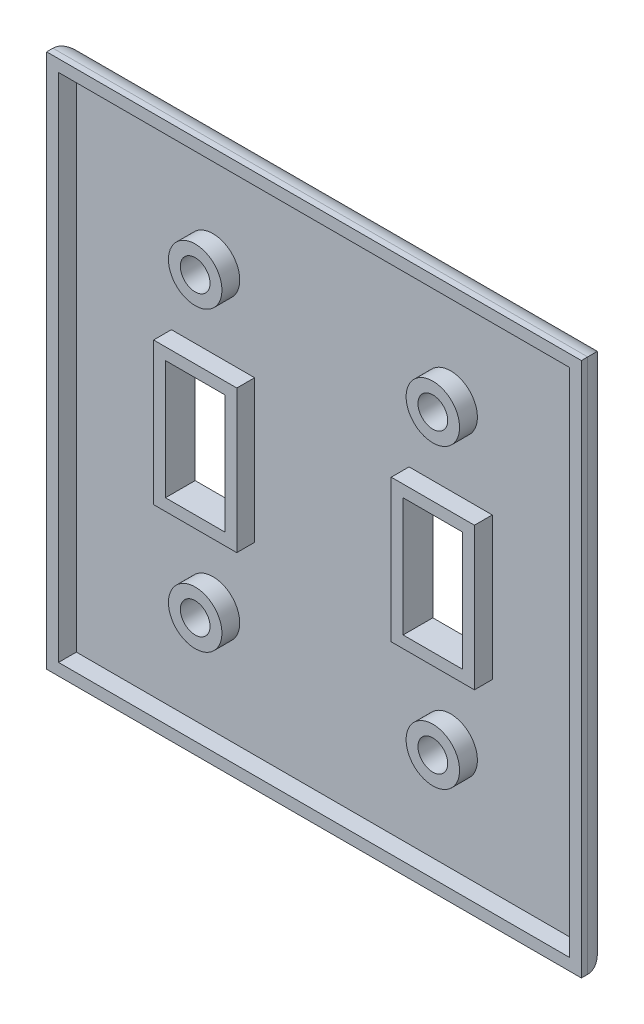
ISO-10303-21;
HEADER;
FILE_DESCRIPTION(('STEP AP214'),'2;1');
FILE_NAME('part.step','',(''),(''),'','','');
FILE_SCHEMA(('AUTOMOTIVE_DESIGN { 1 0 10303 214 1 1 1 1 }'));
ENDSEC;
DATA;
#1=APPLICATION_CONTEXT('core data for automotive mechanical design processes');
#2=APPLICATION_PROTOCOL_DEFINITION('international standard','automotive_design',2000,#1);
#3=PRODUCT_CONTEXT('',#1,'mechanical');
#4=PRODUCT('Part','Part','',(#3));
#5=PRODUCT_RELATED_PRODUCT_CATEGORY('part','',(#4));
#6=PRODUCT_DEFINITION_FORMATION('','',#4);
#7=PRODUCT_DEFINITION_CONTEXT('part definition',#1,'design');
#8=PRODUCT_DEFINITION('design','',#6,#7);
#9=PRODUCT_DEFINITION_SHAPE('','',#8);
#10=(LENGTH_UNIT() NAMED_UNIT(*) SI_UNIT(.MILLI.,.METRE.));
#11=(NAMED_UNIT(*) PLANE_ANGLE_UNIT() SI_UNIT($,.RADIAN.));
#12=(NAMED_UNIT(*) SI_UNIT($,.STERADIAN.) SOLID_ANGLE_UNIT());
#13=UNCERTAINTY_MEASURE_WITH_UNIT(LENGTH_MEASURE(1.E-05),#10,'distance_accuracy_value','');
#14=(GEOMETRIC_REPRESENTATION_CONTEXT(3) GLOBAL_UNCERTAINTY_ASSIGNED_CONTEXT((#13)) GLOBAL_UNIT_ASSIGNED_CONTEXT((#10,
#11,#12)) REPRESENTATION_CONTEXT('',''));
#15=CARTESIAN_POINT('',(0.,0.,0.));
#16=DIRECTION('',(0.,0.,1.));
#17=DIRECTION('',(1.,0.,0.));
#18=AXIS2_PLACEMENT_3D('',#15,#16,#17);
#19=CARTESIAN_POINT('',(0.,0.,6.35));
#20=DIRECTION('',(0.,0.,-1.));
#21=DIRECTION('',(-1.,0.,0.));
#22=AXIS2_PLACEMENT_3D('',#19,#20,#21);
#23=PLANE('',#22);
#24=DIRECTION('',(1.,0.,0.));
#25=VECTOR('',#24,1.);
#26=CARTESIAN_POINT('',(25.4,69.85,6.35));
#27=LINE('',#26,#25);
#28=CARTESIAN_POINT('',(25.4,69.85,6.35));
#29=VERTEX_POINT('',#28);
#30=CARTESIAN_POINT('',(38.1,69.85,6.35));
#31=VERTEX_POINT('',#30);
#32=EDGE_CURVE('E386',#29,#31,#27,.T.);
#33=ORIENTED_EDGE('',*,*,#32,.T.);
#34=DIRECTION('',(0.,-1.,0.));
#35=VECTOR('',#34,1.);
#36=CARTESIAN_POINT('',(38.1,69.85,6.35));
#37=LINE('',#36,#35);
#38=CARTESIAN_POINT('',(38.1,44.45,6.35));
#39=VERTEX_POINT('',#38);
#40=EDGE_CURVE('E401',#31,#39,#37,.T.);
#41=ORIENTED_EDGE('',*,*,#40,.T.);
#42=DIRECTION('',(1.,0.,0.));
#43=VECTOR('',#42,1.);
#44=CARTESIAN_POINT('',(25.4,44.45,6.35));
#45=LINE('',#44,#43);
#46=CARTESIAN_POINT('',(25.4,44.45,6.35));
#47=VERTEX_POINT('',#46);
#48=EDGE_CURVE('E404',#47,#39,#45,.T.);
#49=ORIENTED_EDGE('',*,*,#48,.F.);
#50=DIRECTION('',(0.,-1.,0.));
#51=VECTOR('',#50,1.);
#52=CARTESIAN_POINT('',(25.4,69.85,6.35));
#53=LINE('',#52,#51);
#54=EDGE_CURVE('E390',#29,#47,#53,.T.);
#55=ORIENTED_EDGE('',*,*,#54,.F.);
#56=EDGE_LOOP('',(#33,#41,#49,#55));
#57=FACE_BOUND('',#56,.T.);
#58=DIRECTION('',(1.,0.,0.));
#59=VECTOR('',#58,1.);
#60=CARTESIAN_POINT('',(25.4,72.39,6.35));
#61=LINE('',#60,#59);
#62=CARTESIAN_POINT('',(22.86,72.39,6.35));
#63=VERTEX_POINT('',#62);
#64=CARTESIAN_POINT('',(40.64,72.39,6.35));
#65=VERTEX_POINT('',#64);
#66=EDGE_CURVE('E303',#63,#65,#61,.T.);
#67=ORIENTED_EDGE('',*,*,#66,.F.);
#68=DIRECTION('',(0.,-1.,0.));
#69=VECTOR('',#68,1.);
#70=CARTESIAN_POINT('',(22.86,69.85,6.35));
#71=LINE('',#70,#69);
#72=CARTESIAN_POINT('',(22.86,41.91,6.35));
#73=VERTEX_POINT('',#72);
#74=EDGE_CURVE('E265',#63,#73,#71,.T.);
#75=ORIENTED_EDGE('',*,*,#74,.T.);
#76=DIRECTION('',(1.,0.,0.));
#77=VECTOR('',#76,1.);
#78=CARTESIAN_POINT('',(25.4,41.91,6.35));
#79=LINE('',#78,#77);
#80=CARTESIAN_POINT('',(40.64,41.91,6.35));
#81=VERTEX_POINT('',#80);
#82=EDGE_CURVE('E329',#73,#81,#79,.T.);
#83=ORIENTED_EDGE('',*,*,#82,.T.);
#84=DIRECTION('',(0.,-1.,0.));
#85=VECTOR('',#84,1.);
#86=CARTESIAN_POINT('',(40.64,69.85,6.35));
#87=LINE('',#86,#85);
#88=EDGE_CURVE('E326',#65,#81,#87,.T.);
#89=ORIENTED_EDGE('',*,*,#88,.F.);
#90=EDGE_LOOP('',(#67,#75,#83,#89));
#91=FACE_BOUND('',#90,.T.);
#92=ADVANCED_FACE('F49',(#57,#91),#23,.F.);
#93=CARTESIAN_POINT('',(82.55,25.4,6.35));
#94=DIRECTION('',(0.,0.,-1.));
#95=DIRECTION('',(-1.,0.,0.));
#96=AXIS2_PLACEMENT_3D('',#93,#94,#95);
#97=CIRCLE('',#96,5.715);
#98=CARTESIAN_POINT('',(76.835,25.4,6.35));
#99=VERTEX_POINT('',#98);
#100=EDGE_CURVE('E346',#99,#99,#97,.F.);
#101=ORIENTED_EDGE('',*,*,#100,.T.);
#102=EDGE_LOOP('',(#101));
#103=FACE_BOUND('',#102,.T.);
#104=CARTESIAN_POINT('',(82.55,25.4,6.35));
#105=DIRECTION('',(0.,0.,1.));
#106=DIRECTION('',(1.,0.,0.));
#107=AXIS2_PLACEMENT_3D('',#104,#105,#106);
#108=CIRCLE('',#107,3.175);
#109=CARTESIAN_POINT('',(85.725,25.4,6.35));
#110=VERTEX_POINT('',#109);
#111=EDGE_CURVE('E284',#110,#110,#108,.T.);
#112=ORIENTED_EDGE('',*,*,#111,.F.);
#113=EDGE_LOOP('',(#112));
#114=FACE_BOUND('',#113,.T.);
#115=ADVANCED_FACE('F518',(#103,#114),#23,.F.);
#116=CARTESIAN_POINT('',(31.75,25.4,6.35));
#117=DIRECTION('',(0.,0.,-1.));
#118=DIRECTION('',(-1.,0.,0.));
#119=AXIS2_PLACEMENT_3D('',#116,#117,#118);
#120=CIRCLE('',#119,5.715);
#121=CARTESIAN_POINT('',(26.035,25.4,6.35));
#122=VERTEX_POINT('',#121);
#123=EDGE_CURVE('E294',#122,#122,#120,.F.);
#124=ORIENTED_EDGE('',*,*,#123,.T.);
#125=EDGE_LOOP('',(#124));
#126=FACE_BOUND('',#125,.T.);
#127=CARTESIAN_POINT('',(31.75,25.4,6.35));
#128=DIRECTION('',(0.,0.,1.));
#129=DIRECTION('',(1.,0.,0.));
#130=AXIS2_PLACEMENT_3D('',#127,#128,#129);
#131=CIRCLE('',#130,3.175);
#132=CARTESIAN_POINT('',(34.925,25.4,6.35));
#133=VERTEX_POINT('',#132);
#134=EDGE_CURVE('E418',#133,#133,#131,.T.);
#135=ORIENTED_EDGE('',*,*,#134,.F.);
#136=EDGE_LOOP('',(#135));
#137=FACE_BOUND('',#136,.T.);
#138=ADVANCED_FACE('F526',(#126,#137),#23,.F.);
#139=CARTESIAN_POINT('',(82.55,88.9,6.35));
#140=DIRECTION('',(0.,0.,-1.));
#141=DIRECTION('',(-1.,0.,0.));
#142=AXIS2_PLACEMENT_3D('',#139,#140,#141);
#143=CIRCLE('',#142,5.715);
#144=CARTESIAN_POINT('',(76.835,88.9,6.35));
#145=VERTEX_POINT('',#144);
#146=EDGE_CURVE('E318',#145,#145,#143,.F.);
#147=ORIENTED_EDGE('',*,*,#146,.T.);
#148=EDGE_LOOP('',(#147));
#149=FACE_BOUND('',#148,.T.);
#150=CARTESIAN_POINT('',(82.55,88.9,6.35));
#151=DIRECTION('',(0.,0.,1.));
#152=DIRECTION('',(1.,0.,0.));
#153=AXIS2_PLACEMENT_3D('',#150,#151,#152);
#154=CIRCLE('',#153,3.175);
#155=CARTESIAN_POINT('',(85.725,88.9,6.35));
#156=VERTEX_POINT('',#155);
#157=EDGE_CURVE('E422',#156,#156,#154,.T.);
#158=ORIENTED_EDGE('',*,*,#157,.F.);
#159=EDGE_LOOP('',(#158));
#160=FACE_BOUND('',#159,.T.);
#161=ADVANCED_FACE('F681',(#149,#160),#23,.F.);
#162=DIRECTION('',(0.,-1.,0.));
#163=VECTOR('',#162,1.);
#164=CARTESIAN_POINT('',(0.,0.,6.35));
#165=LINE('',#164,#163);
#166=CARTESIAN_POINT('',(0.,114.3,6.35));
#167=VERTEX_POINT('',#166);
#168=CARTESIAN_POINT('',(0.,0.,6.35));
#169=VERTEX_POINT('',#168);
#170=EDGE_CURVE('E434',#167,#169,#165,.T.);
#171=ORIENTED_EDGE('',*,*,#170,.T.);
#172=DIRECTION('',(1.,0.,0.));
#173=VECTOR('',#172,1.);
#174=CARTESIAN_POINT('',(0.,0.,6.35));
#175=LINE('',#174,#173);
#176=CARTESIAN_POINT('',(114.3,0.,6.35));
#177=VERTEX_POINT('',#176);
#178=EDGE_CURVE('E439',#169,#177,#175,.T.);
#179=ORIENTED_EDGE('',*,*,#178,.T.);
#180=DIRECTION('',(0.,1.,0.));
#181=VECTOR('',#180,1.);
#182=CARTESIAN_POINT('',(114.3,0.,6.35));
#183=LINE('',#182,#181);
#184=CARTESIAN_POINT('',(114.3,114.3,6.35));
#185=VERTEX_POINT('',#184);
#186=EDGE_CURVE('E441',#177,#185,#183,.T.);
#187=ORIENTED_EDGE('',*,*,#186,.T.);
#188=DIRECTION('',(-1.,0.,0.));
#189=VECTOR('',#188,1.);
#190=CARTESIAN_POINT('',(0.,114.3,6.35));
#191=LINE('',#190,#189);
#192=EDGE_CURVE('E443',#185,#167,#191,.T.);
#193=ORIENTED_EDGE('',*,*,#192,.T.);
#194=EDGE_LOOP('',(#171,#179,#187,#193));
#195=FACE_BOUND('',#194,.T.);
#196=DIRECTION('',(0.,-1.,0.));
#197=VECTOR('',#196,1.);
#198=CARTESIAN_POINT('',(2.54,0.,6.35));
#199=LINE('',#198,#197);
#200=CARTESIAN_POINT('',(2.54,111.76,6.35));
#201=VERTEX_POINT('',#200);
#202=CARTESIAN_POINT('',(2.54,2.54,6.35));
#203=VERTEX_POINT('',#202);
#204=EDGE_CURVE('E235',#201,#203,#199,.T.);
#205=ORIENTED_EDGE('',*,*,#204,.F.);
#206=DIRECTION('',(-1.,0.,0.));
#207=VECTOR('',#206,1.);
#208=CARTESIAN_POINT('',(0.,111.76,6.35));
#209=LINE('',#208,#207);
#210=CARTESIAN_POINT('',(111.76,111.76,6.35));
#211=VERTEX_POINT('',#210);
#212=EDGE_CURVE('E241',#211,#201,#209,.T.);
#213=ORIENTED_EDGE('',*,*,#212,.F.);
#214=DIRECTION('',(0.,1.,0.));
#215=VECTOR('',#214,1.);
#216=CARTESIAN_POINT('',(111.76,0.,6.35));
#217=LINE('',#216,#215);
#218=CARTESIAN_POINT('',(111.76,2.54,6.35));
#219=VERTEX_POINT('',#218);
#220=EDGE_CURVE('E311',#219,#211,#217,.T.);
#221=ORIENTED_EDGE('',*,*,#220,.F.);
#222=DIRECTION('',(1.,0.,0.));
#223=VECTOR('',#222,1.);
#224=CARTESIAN_POINT('',(0.,2.54,6.35));
#225=LINE('',#224,#223);
#226=EDGE_CURVE('E309',#203,#219,#225,.T.);
#227=ORIENTED_EDGE('',*,*,#226,.F.);
#228=EDGE_LOOP('',(#205,#213,#221,#227));
#229=FACE_BOUND('',#228,.T.);
#230=ADVANCED_FACE('F502',(#195,#229),#23,.F.);
#231=DIRECTION('',(1.,0.,0.));
#232=VECTOR('',#231,1.);
#233=CARTESIAN_POINT('',(76.1999999999999,69.85,6.35));
#234=LINE('',#233,#232);
#235=CARTESIAN_POINT('',(76.1999999999999,69.85,6.35));
#236=VERTEX_POINT('',#235);
#237=CARTESIAN_POINT('',(88.9,69.85,6.35));
#238=VERTEX_POINT('',#237);
#239=EDGE_CURVE('E352',#236,#238,#234,.T.);
#240=ORIENTED_EDGE('',*,*,#239,.T.);
#241=DIRECTION('',(0.,-1.,0.));
#242=VECTOR('',#241,1.);
#243=CARTESIAN_POINT('',(88.9,69.85,6.35));
#244=LINE('',#243,#242);
#245=CARTESIAN_POINT('',(88.9,44.45,6.35));
#246=VERTEX_POINT('',#245);
#247=EDGE_CURVE('E369',#238,#246,#244,.T.);
#248=ORIENTED_EDGE('',*,*,#247,.T.);
#249=DIRECTION('',(1.,0.,0.));
#250=VECTOR('',#249,1.);
#251=CARTESIAN_POINT('',(76.2,44.45,6.35));
#252=LINE('',#251,#250);
#253=CARTESIAN_POINT('',(76.2,44.45,6.35));
#254=VERTEX_POINT('',#253);
#255=EDGE_CURVE('E372',#254,#246,#252,.T.);
#256=ORIENTED_EDGE('',*,*,#255,.F.);
#257=DIRECTION('',(0.,-1.,0.));
#258=VECTOR('',#257,1.);
#259=CARTESIAN_POINT('',(76.1999999999999,69.85,6.35));
#260=LINE('',#259,#258);
#261=EDGE_CURVE('E358',#236,#254,#260,.T.);
#262=ORIENTED_EDGE('',*,*,#261,.F.);
#263=EDGE_LOOP('',(#240,#248,#256,#262));
#264=FACE_BOUND('',#263,.T.);
#265=DIRECTION('',(1.,0.,0.));
#266=VECTOR('',#265,1.);
#267=CARTESIAN_POINT('',(76.1999999999999,72.39,6.35));
#268=LINE('',#267,#266);
#269=CARTESIAN_POINT('',(73.66,72.39,6.35));
#270=VERTEX_POINT('',#269);
#271=CARTESIAN_POINT('',(91.44,72.39,6.35));
#272=VERTEX_POINT('',#271);
#273=EDGE_CURVE('E334',#270,#272,#268,.T.);
#274=ORIENTED_EDGE('',*,*,#273,.F.);
#275=DIRECTION('',(0.,-1.,0.));
#276=VECTOR('',#275,1.);
#277=CARTESIAN_POINT('',(73.66,69.85,6.35));
#278=LINE('',#277,#276);
#279=CARTESIAN_POINT('',(73.66,41.91,6.35));
#280=VERTEX_POINT('',#279);
#281=EDGE_CURVE('E277',#270,#280,#278,.T.);
#282=ORIENTED_EDGE('',*,*,#281,.T.);
#283=DIRECTION('',(1.,0.,0.));
#284=VECTOR('',#283,1.);
#285=CARTESIAN_POINT('',(76.2,41.91,6.35));
#286=LINE('',#285,#284);
#287=CARTESIAN_POINT('',(91.44,41.91,6.35));
#288=VERTEX_POINT('',#287);
#289=EDGE_CURVE('E341',#280,#288,#286,.T.);
#290=ORIENTED_EDGE('',*,*,#289,.T.);
#291=DIRECTION('',(0.,-1.,0.));
#292=VECTOR('',#291,1.);
#293=CARTESIAN_POINT('',(91.44,69.85,6.35));
#294=LINE('',#293,#292);
#295=EDGE_CURVE('E337',#272,#288,#294,.T.);
#296=ORIENTED_EDGE('',*,*,#295,.F.);
#297=EDGE_LOOP('',(#274,#282,#290,#296));
#298=FACE_BOUND('',#297,.T.);
#299=ADVANCED_FACE('F532',(#264,#298),#23,.F.);
#300=CARTESIAN_POINT('',(31.75,88.9,6.35));
#301=DIRECTION('',(0.,0.,-1.));
#302=DIRECTION('',(-1.,0.,0.));
#303=AXIS2_PLACEMENT_3D('',#300,#301,#302);
#304=CIRCLE('',#303,5.715);
#305=CARTESIAN_POINT('',(26.035,88.9,6.35));
#306=VERTEX_POINT('',#305);
#307=EDGE_CURVE('E255',#306,#306,#304,.F.);
#308=ORIENTED_EDGE('',*,*,#307,.T.);
#309=EDGE_LOOP('',(#308));
#310=FACE_BOUND('',#309,.T.);
#311=CARTESIAN_POINT('',(31.75,88.9,6.35));
#312=DIRECTION('',(0.,0.,1.));
#313=DIRECTION('',(1.,0.,0.));
#314=AXIS2_PLACEMENT_3D('',#311,#312,#313);
#315=CIRCLE('',#314,3.175);
#316=CARTESIAN_POINT('',(34.925,88.9,6.35));
#317=VERTEX_POINT('',#316);
#318=EDGE_CURVE('E428',#317,#317,#315,.T.);
#319=ORIENTED_EDGE('',*,*,#318,.F.);
#320=EDGE_LOOP('',(#319));
#321=FACE_BOUND('',#320,.T.);
#322=ADVANCED_FACE('F521',(#310,#321),#23,.F.);
#323=CARTESIAN_POINT('',(0.,0.,0.));
#324=DIRECTION('',(0.,0.,-1.));
#325=DIRECTION('',(-1.,0.,0.));
#326=AXIS2_PLACEMENT_3D('',#323,#324,#325);
#327=PLANE('',#326);
#328=DIRECTION('',(1.,0.,0.));
#329=VECTOR('',#328,1.);
#330=CARTESIAN_POINT('',(0.,5.,0.));
#331=LINE('',#330,#329);
#332=CARTESIAN_POINT('',(109.3,5.,0.));
#333=VERTEX_POINT('',#332);
#334=CARTESIAN_POINT('',(5.,5.,0.));
#335=VERTEX_POINT('',#334);
#336=EDGE_CURVE('E461',#333,#335,#331,.F.);
#337=ORIENTED_EDGE('',*,*,#336,.T.);
#338=DIRECTION('',(0.,-1.,0.));
#339=VECTOR('',#338,1.);
#340=CARTESIAN_POINT('',(5.,114.3,0.));
#341=LINE('',#340,#339);
#342=CARTESIAN_POINT('',(5.,109.3,0.));
#343=VERTEX_POINT('',#342);
#344=EDGE_CURVE('E463',#335,#343,#341,.F.);
#345=ORIENTED_EDGE('',*,*,#344,.T.);
#346=DIRECTION('',(-1.,0.,0.));
#347=VECTOR('',#346,1.);
#348=CARTESIAN_POINT('',(114.3,109.3,0.));
#349=LINE('',#348,#347);
#350=CARTESIAN_POINT('',(109.3,109.3,0.));
#351=VERTEX_POINT('',#350);
#352=EDGE_CURVE('E457',#343,#351,#349,.F.);
#353=ORIENTED_EDGE('',*,*,#352,.T.);
#354=DIRECTION('',(0.,1.,0.));
#355=VECTOR('',#354,1.);
#356=CARTESIAN_POINT('',(109.3,0.,0.));
#357=LINE('',#356,#355);
#358=EDGE_CURVE('E459',#351,#333,#357,.F.);
#359=ORIENTED_EDGE('',*,*,#358,.T.);
#360=EDGE_LOOP('',(#337,#345,#353,#359));
#361=FACE_BOUND('',#360,.T.);
#362=CARTESIAN_POINT('',(82.55,25.4,0.));
#363=DIRECTION('',(0.,0.,1.));
#364=DIRECTION('',(1.,0.,0.));
#365=AXIS2_PLACEMENT_3D('',#362,#363,#364);
#366=CIRCLE('',#365,3.175);
#367=CARTESIAN_POINT('',(85.725,25.4,0.));
#368=VERTEX_POINT('',#367);
#369=EDGE_CURVE('E349',#368,#368,#366,.T.);
#370=ORIENTED_EDGE('',*,*,#369,.T.);
#371=EDGE_LOOP('',(#370));
#372=FACE_BOUND('',#371,.T.);
#373=CARTESIAN_POINT('',(31.75,25.4,0.));
#374=DIRECTION('',(0.,0.,1.));
#375=DIRECTION('',(1.,0.,0.));
#376=AXIS2_PLACEMENT_3D('',#373,#374,#375);
#377=CIRCLE('',#376,3.175);
#378=CARTESIAN_POINT('',(34.925,25.4,0.));
#379=VERTEX_POINT('',#378);
#380=EDGE_CURVE('E419',#379,#379,#377,.T.);
#381=ORIENTED_EDGE('',*,*,#380,.T.);
#382=EDGE_LOOP('',(#381));
#383=FACE_BOUND('',#382,.T.);
#384=CARTESIAN_POINT('',(82.55,88.9,0.));
#385=DIRECTION('',(0.,0.,1.));
#386=DIRECTION('',(1.,0.,0.));
#387=AXIS2_PLACEMENT_3D('',#384,#385,#386);
#388=CIRCLE('',#387,3.175);
#389=CARTESIAN_POINT('',(85.725,88.9,0.));
#390=VERTEX_POINT('',#389);
#391=EDGE_CURVE('E425',#390,#390,#388,.T.);
#392=ORIENTED_EDGE('',*,*,#391,.T.);
#393=EDGE_LOOP('',(#392));
#394=FACE_BOUND('',#393,.T.);
#395=CARTESIAN_POINT('',(31.75,88.9,0.));
#396=DIRECTION('',(0.,0.,1.));
#397=DIRECTION('',(1.,0.,0.));
#398=AXIS2_PLACEMENT_3D('',#395,#396,#397);
#399=CIRCLE('',#398,3.175);
#400=CARTESIAN_POINT('',(34.925,88.9,0.));
#401=VERTEX_POINT('',#400);
#402=EDGE_CURVE('E431',#401,#401,#399,.T.);
#403=ORIENTED_EDGE('',*,*,#402,.T.);
#404=EDGE_LOOP('',(#403));
#405=FACE_BOUND('',#404,.T.);
#406=DIRECTION('',(0.,-1.,0.));
#407=VECTOR('',#406,1.);
#408=CARTESIAN_POINT('',(38.1,69.85,0.));
#409=LINE('',#408,#407);
#410=CARTESIAN_POINT('',(38.1,69.85,0.));
#411=VERTEX_POINT('',#410);
#412=CARTESIAN_POINT('',(38.1,44.45,0.));
#413=VERTEX_POINT('',#412);
#414=EDGE_CURVE('E389',#411,#413,#409,.T.);
#415=ORIENTED_EDGE('',*,*,#414,.F.);
#416=DIRECTION('',(1.,0.,0.));
#417=VECTOR('',#416,1.);
#418=CARTESIAN_POINT('',(25.4,69.85,0.));
#419=LINE('',#418,#417);
#420=CARTESIAN_POINT('',(25.4,69.85,0.));
#421=VERTEX_POINT('',#420);
#422=EDGE_CURVE('E387',#421,#411,#419,.T.);
#423=ORIENTED_EDGE('',*,*,#422,.F.);
#424=DIRECTION('',(0.,-1.,0.));
#425=VECTOR('',#424,1.);
#426=CARTESIAN_POINT('',(25.4,69.85,0.));
#427=LINE('',#426,#425);
#428=CARTESIAN_POINT('',(25.4,44.45,0.));
#429=VERTEX_POINT('',#428);
#430=EDGE_CURVE('E395',#421,#429,#427,.T.);
#431=ORIENTED_EDGE('',*,*,#430,.T.);
#432=DIRECTION('',(1.,0.,0.));
#433=VECTOR('',#432,1.);
#434=CARTESIAN_POINT('',(25.4,44.45,0.));
#435=LINE('',#434,#433);
#436=EDGE_CURVE('E392',#429,#413,#435,.T.);
#437=ORIENTED_EDGE('',*,*,#436,.T.);
#438=EDGE_LOOP('',(#415,#423,#431,#437));
#439=FACE_BOUND('',#438,.T.);
#440=DIRECTION('',(0.,-1.,0.));
#441=VECTOR('',#440,1.);
#442=CARTESIAN_POINT('',(88.9,69.85,0.));
#443=LINE('',#442,#441);
#444=CARTESIAN_POINT('',(88.9,69.85,0.));
#445=VERTEX_POINT('',#444);
#446=CARTESIAN_POINT('',(88.9,44.45,0.));
#447=VERTEX_POINT('',#446);
#448=EDGE_CURVE('E357',#445,#447,#443,.T.);
#449=ORIENTED_EDGE('',*,*,#448,.F.);
#450=DIRECTION('',(1.,0.,0.));
#451=VECTOR('',#450,1.);
#452=CARTESIAN_POINT('',(76.1999999999999,69.85,0.));
#453=LINE('',#452,#451);
#454=CARTESIAN_POINT('',(76.1999999999999,69.85,0.));
#455=VERTEX_POINT('',#454);
#456=EDGE_CURVE('E355',#455,#445,#453,.T.);
#457=ORIENTED_EDGE('',*,*,#456,.F.);
#458=DIRECTION('',(0.,-1.,0.));
#459=VECTOR('',#458,1.);
#460=CARTESIAN_POINT('',(76.1999999999999,69.85,0.));
#461=LINE('',#460,#459);
#462=CARTESIAN_POINT('',(76.2,44.45,0.));
#463=VERTEX_POINT('',#462);
#464=EDGE_CURVE('E363',#455,#463,#461,.T.);
#465=ORIENTED_EDGE('',*,*,#464,.T.);
#466=DIRECTION('',(1.,0.,0.));
#467=VECTOR('',#466,1.);
#468=CARTESIAN_POINT('',(76.2,44.45,0.));
#469=LINE('',#468,#467);
#470=EDGE_CURVE('E360',#463,#447,#469,.T.);
#471=ORIENTED_EDGE('',*,*,#470,.T.);
#472=EDGE_LOOP('',(#449,#457,#465,#471));
#473=FACE_BOUND('',#472,.T.);
#474=ADVANCED_FACE('F486',(#361,#372,#383,#394,#405,#439,#473),#327,.T.);
#475=CARTESIAN_POINT('',(0.,0.,6.35));
#476=DIRECTION('',(1.,0.,0.));
#477=DIRECTION('',(0.,0.,-1.));
#478=AXIS2_PLACEMENT_3D('',#475,#476,#477);
#479=PLANE('',#478);
#480=DIRECTION('',(0.,0.,-1.));
#481=VECTOR('',#480,1.);
#482=CARTESIAN_POINT('',(0.,114.3,6.35));
#483=LINE('',#482,#481);
#484=CARTESIAN_POINT('',(0.,114.3,5.));
#485=VERTEX_POINT('',#484);
#486=EDGE_CURVE('E445',#167,#485,#483,.T.);
#487=ORIENTED_EDGE('',*,*,#486,.T.);
#488=DIRECTION('',(0.,-1.,0.));
#489=VECTOR('',#488,1.);
#490=CARTESIAN_POINT('',(0.,0.,5.));
#491=LINE('',#490,#489);
#492=CARTESIAN_POINT('',(0.,0.,5.));
#493=VERTEX_POINT('',#492);
#494=EDGE_CURVE('E454',#485,#493,#491,.T.);
#495=ORIENTED_EDGE('',*,*,#494,.T.);
#496=DIRECTION('',(0.,0.,-1.));
#497=VECTOR('',#496,1.);
#498=CARTESIAN_POINT('',(0.,0.,6.35));
#499=LINE('',#498,#497);
#500=EDGE_CURVE('E452',#169,#493,#499,.T.);
#501=ORIENTED_EDGE('',*,*,#500,.F.);
#502=ORIENTED_EDGE('',*,*,#170,.F.);
#503=EDGE_LOOP('',(#487,#495,#501,#502));
#504=FACE_BOUND('',#503,.T.);
#505=ADVANCED_FACE('F496',(#504),#479,.F.);
#506=CARTESIAN_POINT('',(0.,0.,6.35));
#507=DIRECTION('',(0.,1.,0.));
#508=DIRECTION('',(0.,0.,1.));
#509=AXIS2_PLACEMENT_3D('',#506,#507,#508);
#510=PLANE('',#509);
#511=ORIENTED_EDGE('',*,*,#500,.T.);
#512=DIRECTION('',(1.,0.,0.));
#513=VECTOR('',#512,1.);
#514=CARTESIAN_POINT('',(114.3,0.,5.));
#515=LINE('',#514,#513);
#516=CARTESIAN_POINT('',(114.3,0.,5.));
#517=VERTEX_POINT('',#516);
#518=EDGE_CURVE('E73',#493,#517,#515,.T.);
#519=ORIENTED_EDGE('',*,*,#518,.T.);
#520=DIRECTION('',(0.,0.,-1.));
#521=VECTOR('',#520,1.);
#522=CARTESIAN_POINT('',(114.3,0.,6.35));
#523=LINE('',#522,#521);
#524=EDGE_CURVE('E450',#177,#517,#523,.T.);
#525=ORIENTED_EDGE('',*,*,#524,.F.);
#526=ORIENTED_EDGE('',*,*,#178,.F.);
#527=EDGE_LOOP('',(#511,#519,#525,#526));
#528=FACE_BOUND('',#527,.T.);
#529=ADVANCED_FACE('F499',(#528),#510,.F.);
#530=CARTESIAN_POINT('',(114.3,0.,6.35));
#531=DIRECTION('',(-1.,0.,0.));
#532=DIRECTION('',(0.,0.,1.));
#533=AXIS2_PLACEMENT_3D('',#530,#531,#532);
#534=PLANE('',#533);
#535=ORIENTED_EDGE('',*,*,#524,.T.);
#536=DIRECTION('',(0.,1.,0.));
#537=VECTOR('',#536,1.);
#538=CARTESIAN_POINT('',(114.3,114.3,5.));
#539=LINE('',#538,#537);
#540=CARTESIAN_POINT('',(114.3,114.3,5.));
#541=VERTEX_POINT('',#540);
#542=EDGE_CURVE('E58',#517,#541,#539,.T.);
#543=ORIENTED_EDGE('',*,*,#542,.T.);
#544=DIRECTION('',(0.,0.,-1.));
#545=VECTOR('',#544,1.);
#546=CARTESIAN_POINT('',(114.3,114.3,6.35));
#547=LINE('',#546,#545);
#548=EDGE_CURVE('E448',#185,#541,#547,.T.);
#549=ORIENTED_EDGE('',*,*,#548,.F.);
#550=ORIENTED_EDGE('',*,*,#186,.F.);
#551=EDGE_LOOP('',(#535,#543,#549,#550));
#552=FACE_BOUND('',#551,.T.);
#553=ADVANCED_FACE('F507',(#552),#534,.F.);
#554=CARTESIAN_POINT('',(0.,114.3,6.35));
#555=DIRECTION('',(0.,-1.,0.));
#556=DIRECTION('',(0.,0.,-1.));
#557=AXIS2_PLACEMENT_3D('',#554,#555,#556);
#558=PLANE('',#557);
#559=ORIENTED_EDGE('',*,*,#548,.T.);
#560=DIRECTION('',(-1.,0.,0.));
#561=VECTOR('',#560,1.);
#562=CARTESIAN_POINT('',(0.,114.3,5.));
#563=LINE('',#562,#561);
#564=EDGE_CURVE('E13',#541,#485,#563,.T.);
#565=ORIENTED_EDGE('',*,*,#564,.T.);
#566=ORIENTED_EDGE('',*,*,#486,.F.);
#567=ORIENTED_EDGE('',*,*,#192,.F.);
#568=EDGE_LOOP('',(#559,#565,#566,#567));
#569=FACE_BOUND('',#568,.T.);
#570=ADVANCED_FACE('F506',(#569),#558,.F.);
#571=CARTESIAN_POINT('',(31.75,88.9,0.));
#572=DIRECTION('',(0.,0.,1.));
#573=DIRECTION('',(1.,0.,0.));
#574=AXIS2_PLACEMENT_3D('',#571,#572,#573);
#575=CYLINDRICAL_SURFACE('',#574,3.175);
#576=ORIENTED_EDGE('',*,*,#402,.F.);
#577=EDGE_LOOP('',(#576));
#578=FACE_BOUND('',#577,.T.);
#579=ORIENTED_EDGE('',*,*,#318,.T.);
#580=EDGE_LOOP('',(#579));
#581=FACE_BOUND('',#580,.T.);
#582=ADVANCED_FACE('F514',(#578,#581),#575,.F.);
#583=CARTESIAN_POINT('',(82.55,88.9,0.));
#584=DIRECTION('',(0.,0.,1.));
#585=DIRECTION('',(1.,0.,0.));
#586=AXIS2_PLACEMENT_3D('',#583,#584,#585);
#587=CYLINDRICAL_SURFACE('',#586,3.175);
#588=ORIENTED_EDGE('',*,*,#391,.F.);
#589=EDGE_LOOP('',(#588));
#590=FACE_BOUND('',#589,.T.);
#591=ORIENTED_EDGE('',*,*,#157,.T.);
#592=EDGE_LOOP('',(#591));
#593=FACE_BOUND('',#592,.T.);
#594=ADVANCED_FACE('F545',(#590,#593),#587,.F.);
#595=CARTESIAN_POINT('',(31.75,25.4,0.));
#596=DIRECTION('',(0.,0.,1.));
#597=DIRECTION('',(1.,0.,0.));
#598=AXIS2_PLACEMENT_3D('',#595,#596,#597);
#599=CYLINDRICAL_SURFACE('',#598,3.175);
#600=ORIENTED_EDGE('',*,*,#380,.F.);
#601=EDGE_LOOP('',(#600));
#602=FACE_BOUND('',#601,.T.);
#603=ORIENTED_EDGE('',*,*,#134,.T.);
#604=EDGE_LOOP('',(#603));
#605=FACE_BOUND('',#604,.T.);
#606=ADVANCED_FACE('F551',(#602,#605),#599,.F.);
#607=CARTESIAN_POINT('',(25.4,69.85,0.));
#608=DIRECTION('',(0.,-1.,0.));
#609=DIRECTION('',(0.,0.,-1.));
#610=AXIS2_PLACEMENT_3D('',#607,#608,#609);
#611=PLANE('',#610);
#612=ORIENTED_EDGE('',*,*,#32,.F.);
#613=DIRECTION('',(0.,0.,1.));
#614=VECTOR('',#613,1.);
#615=CARTESIAN_POINT('',(25.4,69.85,0.));
#616=LINE('',#615,#614);
#617=EDGE_CURVE('E398',#421,#29,#616,.T.);
#618=ORIENTED_EDGE('',*,*,#617,.F.);
#619=ORIENTED_EDGE('',*,*,#422,.T.);
#620=DIRECTION('',(0.,0.,1.));
#621=VECTOR('',#620,1.);
#622=CARTESIAN_POINT('',(38.1,69.85,0.));
#623=LINE('',#622,#621);
#624=EDGE_CURVE('E415',#411,#31,#623,.T.);
#625=ORIENTED_EDGE('',*,*,#624,.T.);
#626=EDGE_LOOP('',(#612,#618,#619,#625));
#627=FACE_BOUND('',#626,.T.);
#628=ADVANCED_FACE('F558',(#627),#611,.T.);
#629=CARTESIAN_POINT('',(38.1,69.85,0.));
#630=DIRECTION('',(-1.,0.,0.));
#631=DIRECTION('',(0.,0.,1.));
#632=AXIS2_PLACEMENT_3D('',#629,#630,#631);
#633=PLANE('',#632);
#634=ORIENTED_EDGE('',*,*,#40,.F.);
#635=ORIENTED_EDGE('',*,*,#624,.F.);
#636=ORIENTED_EDGE('',*,*,#414,.T.);
#637=DIRECTION('',(0.,0.,1.));
#638=VECTOR('',#637,1.);
#639=CARTESIAN_POINT('',(38.1,44.45,0.));
#640=LINE('',#639,#638);
#641=EDGE_CURVE('E413',#413,#39,#640,.T.);
#642=ORIENTED_EDGE('',*,*,#641,.T.);
#643=EDGE_LOOP('',(#634,#635,#636,#642));
#644=FACE_BOUND('',#643,.T.);
#645=ADVANCED_FACE('F562',(#644),#633,.T.);
#646=CARTESIAN_POINT('',(25.4,44.45,0.));
#647=DIRECTION('',(0.,-1.,0.));
#648=DIRECTION('',(0.,0.,-1.));
#649=AXIS2_PLACEMENT_3D('',#646,#647,#648);
#650=PLANE('',#649);
#651=ORIENTED_EDGE('',*,*,#48,.T.);
#652=ORIENTED_EDGE('',*,*,#641,.F.);
#653=ORIENTED_EDGE('',*,*,#436,.F.);
#654=DIRECTION('',(0.,0.,1.));
#655=VECTOR('',#654,1.);
#656=CARTESIAN_POINT('',(25.4,44.45,0.));
#657=LINE('',#656,#655);
#658=EDGE_CURVE('E411',#429,#47,#657,.T.);
#659=ORIENTED_EDGE('',*,*,#658,.T.);
#660=EDGE_LOOP('',(#651,#652,#653,#659));
#661=FACE_BOUND('',#660,.T.);
#662=ADVANCED_FACE('F566',(#661),#650,.F.);
#663=CARTESIAN_POINT('',(25.4,69.85,0.));
#664=DIRECTION('',(-1.,0.,0.));
#665=DIRECTION('',(0.,-1.,0.));
#666=AXIS2_PLACEMENT_3D('',#663,#664,#665);
#667=PLANE('',#666);
#668=ORIENTED_EDGE('',*,*,#54,.T.);
#669=ORIENTED_EDGE('',*,*,#658,.F.);
#670=ORIENTED_EDGE('',*,*,#430,.F.);
#671=ORIENTED_EDGE('',*,*,#617,.T.);
#672=EDGE_LOOP('',(#668,#669,#670,#671));
#673=FACE_BOUND('',#672,.T.);
#674=ADVANCED_FACE('F570',(#673),#667,.F.);
#675=CARTESIAN_POINT('',(76.1999999999999,69.85,0.));
#676=DIRECTION('',(0.,-1.,0.));
#677=DIRECTION('',(0.,0.,-1.));
#678=AXIS2_PLACEMENT_3D('',#675,#676,#677);
#679=PLANE('',#678);
#680=ORIENTED_EDGE('',*,*,#239,.F.);
#681=DIRECTION('',(0.,0.,1.));
#682=VECTOR('',#681,1.);
#683=CARTESIAN_POINT('',(76.1999999999999,69.85,0.));
#684=LINE('',#683,#682);
#685=EDGE_CURVE('E366',#455,#236,#684,.T.);
#686=ORIENTED_EDGE('',*,*,#685,.F.);
#687=ORIENTED_EDGE('',*,*,#456,.T.);
#688=DIRECTION('',(0.,0.,1.));
#689=VECTOR('',#688,1.);
#690=CARTESIAN_POINT('',(88.9,69.85,0.));
#691=LINE('',#690,#689);
#692=EDGE_CURVE('E383',#445,#238,#691,.T.);
#693=ORIENTED_EDGE('',*,*,#692,.T.);
#694=EDGE_LOOP('',(#680,#686,#687,#693));
#695=FACE_BOUND('',#694,.T.);
#696=ADVANCED_FACE('F574',(#695),#679,.T.);
#697=CARTESIAN_POINT('',(88.9,69.85,0.));
#698=DIRECTION('',(-1.,0.,0.));
#699=DIRECTION('',(0.,0.,1.));
#700=AXIS2_PLACEMENT_3D('',#697,#698,#699);
#701=PLANE('',#700);
#702=ORIENTED_EDGE('',*,*,#247,.F.);
#703=ORIENTED_EDGE('',*,*,#692,.F.);
#704=ORIENTED_EDGE('',*,*,#448,.T.);
#705=DIRECTION('',(0.,0.,1.));
#706=VECTOR('',#705,1.);
#707=CARTESIAN_POINT('',(88.9,44.45,0.));
#708=LINE('',#707,#706);
#709=EDGE_CURVE('E381',#447,#246,#708,.T.);
#710=ORIENTED_EDGE('',*,*,#709,.T.);
#711=EDGE_LOOP('',(#702,#703,#704,#710));
#712=FACE_BOUND('',#711,.T.);
#713=ADVANCED_FACE('F578',(#712),#701,.T.);
#714=CARTESIAN_POINT('',(76.2,44.45,0.));
#715=DIRECTION('',(0.,-1.,0.));
#716=DIRECTION('',(1.,0.,0.));
#717=AXIS2_PLACEMENT_3D('',#714,#715,#716);
#718=PLANE('',#717);
#719=ORIENTED_EDGE('',*,*,#255,.T.);
#720=ORIENTED_EDGE('',*,*,#709,.F.);
#721=ORIENTED_EDGE('',*,*,#470,.F.);
#722=DIRECTION('',(0.,0.,1.));
#723=VECTOR('',#722,1.);
#724=CARTESIAN_POINT('',(76.2,44.45,0.));
#725=LINE('',#724,#723);
#726=EDGE_CURVE('E379',#463,#254,#725,.T.);
#727=ORIENTED_EDGE('',*,*,#726,.T.);
#728=EDGE_LOOP('',(#719,#720,#721,#727));
#729=FACE_BOUND('',#728,.T.);
#730=ADVANCED_FACE('F582',(#729),#718,.F.);
#731=CARTESIAN_POINT('',(76.1999999999999,69.85,0.));
#732=DIRECTION('',(-1.,0.,0.));
#733=DIRECTION('',(0.,-1.,0.));
#734=AXIS2_PLACEMENT_3D('',#731,#732,#733);
#735=PLANE('',#734);
#736=ORIENTED_EDGE('',*,*,#261,.T.);
#737=ORIENTED_EDGE('',*,*,#726,.F.);
#738=ORIENTED_EDGE('',*,*,#464,.F.);
#739=ORIENTED_EDGE('',*,*,#685,.T.);
#740=EDGE_LOOP('',(#736,#737,#738,#739));
#741=FACE_BOUND('',#740,.T.);
#742=ADVANCED_FACE('F586',(#741),#735,.F.);
#743=CARTESIAN_POINT('',(82.55,25.4,0.));
#744=DIRECTION('',(0.,0.,1.));
#745=DIRECTION('',(1.,0.,0.));
#746=AXIS2_PLACEMENT_3D('',#743,#744,#745);
#747=CYLINDRICAL_SURFACE('',#746,3.175);
#748=ORIENTED_EDGE('',*,*,#369,.F.);
#749=EDGE_LOOP('',(#748));
#750=FACE_BOUND('',#749,.T.);
#751=ORIENTED_EDGE('',*,*,#111,.T.);
#752=EDGE_LOOP('',(#751));
#753=FACE_BOUND('',#752,.T.);
#754=ADVANCED_FACE('F590',(#750,#753),#747,.F.);
#755=CARTESIAN_POINT('',(0.,0.,2.54));
#756=DIRECTION('',(0.,0.,-1.));
#757=DIRECTION('',(-1.,0.,0.));
#758=AXIS2_PLACEMENT_3D('',#755,#756,#757);
#759=PLANE('',#758);
#760=CARTESIAN_POINT('',(82.55,25.4,2.54));
#761=DIRECTION('',(0.,0.,-1.));
#762=DIRECTION('',(-1.,0.,0.));
#763=AXIS2_PLACEMENT_3D('',#760,#761,#762);
#764=CIRCLE('',#763,5.715);
#765=CARTESIAN_POINT('',(76.835,25.4,2.54));
#766=VERTEX_POINT('',#765);
#767=EDGE_CURVE('E338',#766,#766,#764,.F.);
#768=ORIENTED_EDGE('',*,*,#767,.F.);
#769=EDGE_LOOP('',(#768));
#770=FACE_BOUND('',#769,.T.);
#771=CARTESIAN_POINT('',(31.75,25.4,2.54));
#772=DIRECTION('',(0.,0.,-1.));
#773=DIRECTION('',(-1.,0.,0.));
#774=AXIS2_PLACEMENT_3D('',#771,#772,#773);
#775=CIRCLE('',#774,5.715);
#776=CARTESIAN_POINT('',(26.035,25.4,2.54));
#777=VERTEX_POINT('',#776);
#778=EDGE_CURVE('E321',#777,#777,#775,.F.);
#779=ORIENTED_EDGE('',*,*,#778,.F.);
#780=EDGE_LOOP('',(#779));
#781=FACE_BOUND('',#780,.T.);
#782=CARTESIAN_POINT('',(82.55,88.9,2.54));
#783=DIRECTION('',(0.,0.,-1.));
#784=DIRECTION('',(-1.,0.,0.));
#785=AXIS2_PLACEMENT_3D('',#782,#783,#784);
#786=CIRCLE('',#785,5.715);
#787=CARTESIAN_POINT('',(76.835,88.9,2.54));
#788=VERTEX_POINT('',#787);
#789=EDGE_CURVE('E317',#788,#788,#786,.F.);
#790=ORIENTED_EDGE('',*,*,#789,.F.);
#791=EDGE_LOOP('',(#790));
#792=FACE_BOUND('',#791,.T.);
#793=CARTESIAN_POINT('',(31.75,88.9,2.54));
#794=DIRECTION('',(0.,0.,-1.));
#795=DIRECTION('',(-1.,0.,0.));
#796=AXIS2_PLACEMENT_3D('',#793,#794,#795);
#797=CIRCLE('',#796,5.715);
#798=CARTESIAN_POINT('',(26.035,88.9,2.54));
#799=VERTEX_POINT('',#798);
#800=EDGE_CURVE('E251',#799,#799,#797,.F.);
#801=ORIENTED_EDGE('',*,*,#800,.F.);
#802=EDGE_LOOP('',(#801));
#803=FACE_BOUND('',#802,.T.);
#804=DIRECTION('',(0.,-1.,0.));
#805=VECTOR('',#804,1.);
#806=CARTESIAN_POINT('',(2.54,0.,2.54));
#807=LINE('',#806,#805);
#808=CARTESIAN_POINT('',(2.54,111.76,2.54));
#809=VERTEX_POINT('',#808);
#810=CARTESIAN_POINT('',(2.54,2.54,2.54));
#811=VERTEX_POINT('',#810);
#812=EDGE_CURVE('E230',#809,#811,#807,.T.);
#813=ORIENTED_EDGE('',*,*,#812,.T.);
#814=DIRECTION('',(1.,0.,0.));
#815=VECTOR('',#814,1.);
#816=CARTESIAN_POINT('',(0.,2.54,2.54));
#817=LINE('',#816,#815);
#818=CARTESIAN_POINT('',(111.76,2.54,2.54));
#819=VERTEX_POINT('',#818);
#820=EDGE_CURVE('E250',#811,#819,#817,.T.);
#821=ORIENTED_EDGE('',*,*,#820,.T.);
#822=DIRECTION('',(0.,1.,0.));
#823=VECTOR('',#822,1.);
#824=CARTESIAN_POINT('',(111.76,0.,2.54));
#825=LINE('',#824,#823);
#826=CARTESIAN_POINT('',(111.76,111.76,2.54));
#827=VERTEX_POINT('',#826);
#828=EDGE_CURVE('E232',#819,#827,#825,.T.);
#829=ORIENTED_EDGE('',*,*,#828,.T.);
#830=DIRECTION('',(-1.,0.,0.));
#831=VECTOR('',#830,1.);
#832=CARTESIAN_POINT('',(0.,111.76,2.54));
#833=LINE('',#832,#831);
#834=EDGE_CURVE('E225',#827,#809,#833,.T.);
#835=ORIENTED_EDGE('',*,*,#834,.T.);
#836=EDGE_LOOP('',(#813,#821,#829,#835));
#837=FACE_BOUND('',#836,.T.);
#838=DIRECTION('',(0.,-1.,0.));
#839=VECTOR('',#838,1.);
#840=CARTESIAN_POINT('',(40.64,69.85,2.54));
#841=LINE('',#840,#839);
#842=CARTESIAN_POINT('',(40.64,72.39,2.54));
#843=VERTEX_POINT('',#842);
#844=CARTESIAN_POINT('',(40.64,41.91,2.54));
#845=VERTEX_POINT('',#844);
#846=EDGE_CURVE('E260',#843,#845,#841,.T.);
#847=ORIENTED_EDGE('',*,*,#846,.T.);
#848=DIRECTION('',(1.,0.,0.));
#849=VECTOR('',#848,1.);
#850=CARTESIAN_POINT('',(25.4,41.91,2.54));
#851=LINE('',#850,#849);
#852=CARTESIAN_POINT('',(22.86,41.91,2.54));
#853=VERTEX_POINT('',#852);
#854=EDGE_CURVE('E262',#853,#845,#851,.T.);
#855=ORIENTED_EDGE('',*,*,#854,.F.);
#856=DIRECTION('',(0.,-1.,0.));
#857=VECTOR('',#856,1.);
#858=CARTESIAN_POINT('',(22.86,69.85,2.54));
#859=LINE('',#858,#857);
#860=CARTESIAN_POINT('',(22.86,72.39,2.54));
#861=VERTEX_POINT('',#860);
#862=EDGE_CURVE('E266',#861,#853,#859,.T.);
#863=ORIENTED_EDGE('',*,*,#862,.F.);
#864=DIRECTION('',(1.,0.,0.));
#865=VECTOR('',#864,1.);
#866=CARTESIAN_POINT('',(25.4,72.39,2.54));
#867=LINE('',#866,#865);
#868=EDGE_CURVE('E263',#861,#843,#867,.T.);
#869=ORIENTED_EDGE('',*,*,#868,.T.);
#870=EDGE_LOOP('',(#847,#855,#863,#869));
#871=FACE_BOUND('',#870,.T.);
#872=DIRECTION('',(0.,-1.,0.));
#873=VECTOR('',#872,1.);
#874=CARTESIAN_POINT('',(91.44,69.85,2.54));
#875=LINE('',#874,#873);
#876=CARTESIAN_POINT('',(91.44,72.39,2.54));
#877=VERTEX_POINT('',#876);
#878=CARTESIAN_POINT('',(91.44,41.91,2.54));
#879=VERTEX_POINT('',#878);
#880=EDGE_CURVE('E272',#877,#879,#875,.T.);
#881=ORIENTED_EDGE('',*,*,#880,.T.);
#882=DIRECTION('',(1.,0.,0.));
#883=VECTOR('',#882,1.);
#884=CARTESIAN_POINT('',(76.2,41.91,2.54));
#885=LINE('',#884,#883);
#886=CARTESIAN_POINT('',(73.66,41.91,2.54));
#887=VERTEX_POINT('',#886);
#888=EDGE_CURVE('E274',#887,#879,#885,.T.);
#889=ORIENTED_EDGE('',*,*,#888,.F.);
#890=DIRECTION('',(0.,-1.,0.));
#891=VECTOR('',#890,1.);
#892=CARTESIAN_POINT('',(73.66,69.85,2.54));
#893=LINE('',#892,#891);
#894=CARTESIAN_POINT('',(73.66,72.39,2.54));
#895=VERTEX_POINT('',#894);
#896=EDGE_CURVE('E278',#895,#887,#893,.T.);
#897=ORIENTED_EDGE('',*,*,#896,.F.);
#898=DIRECTION('',(1.,0.,0.));
#899=VECTOR('',#898,1.);
#900=CARTESIAN_POINT('',(76.1999999999999,72.39,2.54));
#901=LINE('',#900,#899);
#902=EDGE_CURVE('E275',#895,#877,#901,.T.);
#903=ORIENTED_EDGE('',*,*,#902,.T.);
#904=EDGE_LOOP('',(#881,#889,#897,#903));
#905=FACE_BOUND('',#904,.T.);
#906=ADVANCED_FACE('F227',(#770,#781,#792,#803,#837,#871,#905),#759,.F.);
#907=CARTESIAN_POINT('',(2.54,0.,6.35));
#908=DIRECTION('',(1.,0.,0.));
#909=DIRECTION('',(0.,0.,-1.));
#910=AXIS2_PLACEMENT_3D('',#907,#908,#909);
#911=PLANE('',#910);
#912=ORIENTED_EDGE('',*,*,#812,.F.);
#913=DIRECTION('',(0.,0.,-1.));
#914=VECTOR('',#913,1.);
#915=CARTESIAN_POINT('',(2.54,111.76,6.35));
#916=LINE('',#915,#914);
#917=EDGE_CURVE('E238',#201,#809,#916,.T.);
#918=ORIENTED_EDGE('',*,*,#917,.F.);
#919=ORIENTED_EDGE('',*,*,#204,.T.);
#920=DIRECTION('',(0.,0.,-1.));
#921=VECTOR('',#920,1.);
#922=CARTESIAN_POINT('',(2.54,2.54,6.35));
#923=LINE('',#922,#921);
#924=EDGE_CURVE('E249',#203,#811,#923,.T.);
#925=ORIENTED_EDGE('',*,*,#924,.T.);
#926=EDGE_LOOP('',(#912,#918,#919,#925));
#927=FACE_BOUND('',#926,.T.);
#928=ADVANCED_FACE('F247',(#927),#911,.T.);
#929=CARTESIAN_POINT('',(0.,2.54,6.35));
#930=DIRECTION('',(0.,1.,0.));
#931=DIRECTION('',(0.,0.,1.));
#932=AXIS2_PLACEMENT_3D('',#929,#930,#931);
#933=PLANE('',#932);
#934=ORIENTED_EDGE('',*,*,#820,.F.);
#935=ORIENTED_EDGE('',*,*,#924,.F.);
#936=ORIENTED_EDGE('',*,*,#226,.T.);
#937=DIRECTION('',(0.,0.,-1.));
#938=VECTOR('',#937,1.);
#939=CARTESIAN_POINT('',(111.76,2.54,6.35));
#940=LINE('',#939,#938);
#941=EDGE_CURVE('E285',#219,#819,#940,.T.);
#942=ORIENTED_EDGE('',*,*,#941,.T.);
#943=EDGE_LOOP('',(#934,#935,#936,#942));
#944=FACE_BOUND('',#943,.T.);
#945=ADVANCED_FACE('F648',(#944),#933,.T.);
#946=CARTESIAN_POINT('',(111.76,0.,6.35));
#947=DIRECTION('',(-1.,0.,0.));
#948=DIRECTION('',(0.,0.,1.));
#949=AXIS2_PLACEMENT_3D('',#946,#947,#948);
#950=PLANE('',#949);
#951=ORIENTED_EDGE('',*,*,#828,.F.);
#952=ORIENTED_EDGE('',*,*,#941,.F.);
#953=ORIENTED_EDGE('',*,*,#220,.T.);
#954=DIRECTION('',(0.,0.,-1.));
#955=VECTOR('',#954,1.);
#956=CARTESIAN_POINT('',(111.76,111.76,6.35));
#957=LINE('',#956,#955);
#958=EDGE_CURVE('E244',#211,#827,#957,.T.);
#959=ORIENTED_EDGE('',*,*,#958,.T.);
#960=EDGE_LOOP('',(#951,#952,#953,#959));
#961=FACE_BOUND('',#960,.T.);
#962=ADVANCED_FACE('F645',(#961),#950,.T.);
#963=CARTESIAN_POINT('',(0.,111.76,6.35));
#964=DIRECTION('',(0.,-1.,0.));
#965=DIRECTION('',(0.,0.,-1.));
#966=AXIS2_PLACEMENT_3D('',#963,#964,#965);
#967=PLANE('',#966);
#968=ORIENTED_EDGE('',*,*,#834,.F.);
#969=ORIENTED_EDGE('',*,*,#958,.F.);
#970=ORIENTED_EDGE('',*,*,#212,.T.);
#971=ORIENTED_EDGE('',*,*,#917,.T.);
#972=EDGE_LOOP('',(#968,#969,#970,#971));
#973=FACE_BOUND('',#972,.T.);
#974=ADVANCED_FACE('F239',(#973),#967,.T.);
#975=CARTESIAN_POINT('',(31.75,88.9,0.));
#976=DIRECTION('',(0.,0.,1.));
#977=DIRECTION('',(1.,0.,0.));
#978=AXIS2_PLACEMENT_3D('',#975,#976,#977);
#979=CYLINDRICAL_SURFACE('',#978,5.715);
#980=ORIENTED_EDGE('',*,*,#800,.T.);
#981=EDGE_LOOP('',(#980));
#982=FACE_BOUND('',#981,.T.);
#983=ORIENTED_EDGE('',*,*,#307,.F.);
#984=EDGE_LOOP('',(#983));
#985=FACE_BOUND('',#984,.T.);
#986=ADVANCED_FACE('F638',(#982,#985),#979,.T.);
#987=CARTESIAN_POINT('',(82.55,88.9,0.));
#988=DIRECTION('',(0.,0.,1.));
#989=DIRECTION('',(1.,0.,0.));
#990=AXIS2_PLACEMENT_3D('',#987,#988,#989);
#991=CYLINDRICAL_SURFACE('',#990,5.715);
#992=ORIENTED_EDGE('',*,*,#789,.T.);
#993=EDGE_LOOP('',(#992));
#994=FACE_BOUND('',#993,.T.);
#995=ORIENTED_EDGE('',*,*,#146,.F.);
#996=EDGE_LOOP('',(#995));
#997=FACE_BOUND('',#996,.T.);
#998=ADVANCED_FACE('F634',(#994,#997),#991,.T.);
#999=CARTESIAN_POINT('',(31.75,25.4,0.));
#1000=DIRECTION('',(0.,0.,1.));
#1001=DIRECTION('',(1.,0.,0.));
#1002=AXIS2_PLACEMENT_3D('',#999,#1000,#1001);
#1003=CYLINDRICAL_SURFACE('',#1002,5.715);
#1004=ORIENTED_EDGE('',*,*,#778,.T.);
#1005=EDGE_LOOP('',(#1004));
#1006=FACE_BOUND('',#1005,.T.);
#1007=ORIENTED_EDGE('',*,*,#123,.F.);
#1008=EDGE_LOOP('',(#1007));
#1009=FACE_BOUND('',#1008,.T.);
#1010=ADVANCED_FACE('F630',(#1006,#1009),#1003,.T.);
#1011=CARTESIAN_POINT('',(25.4,72.39,0.));
#1012=DIRECTION('',(0.,-1.,0.));
#1013=DIRECTION('',(0.,0.,-1.));
#1014=AXIS2_PLACEMENT_3D('',#1011,#1012,#1013);
#1015=PLANE('',#1014);
#1016=ORIENTED_EDGE('',*,*,#66,.T.);
#1017=DIRECTION('',(0.,0.,1.));
#1018=VECTOR('',#1017,1.);
#1019=CARTESIAN_POINT('',(40.64,72.39,0.));
#1020=LINE('',#1019,#1018);
#1021=EDGE_CURVE('E292',#843,#65,#1020,.T.);
#1022=ORIENTED_EDGE('',*,*,#1021,.F.);
#1023=ORIENTED_EDGE('',*,*,#868,.F.);
#1024=DIRECTION('',(0.,0.,1.));
#1025=VECTOR('',#1024,1.);
#1026=CARTESIAN_POINT('',(22.86,72.39,0.));
#1027=LINE('',#1026,#1025);
#1028=EDGE_CURVE('E269',#861,#63,#1027,.T.);
#1029=ORIENTED_EDGE('',*,*,#1028,.T.);
#1030=EDGE_LOOP('',(#1016,#1022,#1023,#1029));
#1031=FACE_BOUND('',#1030,.T.);
#1032=ADVANCED_FACE('F626',(#1031),#1015,.F.);
#1033=CARTESIAN_POINT('',(40.64,69.85,0.));
#1034=DIRECTION('',(-1.,0.,0.));
#1035=DIRECTION('',(0.,0.,1.));
#1036=AXIS2_PLACEMENT_3D('',#1033,#1034,#1035);
#1037=PLANE('',#1036);
#1038=ORIENTED_EDGE('',*,*,#88,.T.);
#1039=DIRECTION('',(0.,0.,1.));
#1040=VECTOR('',#1039,1.);
#1041=CARTESIAN_POINT('',(40.64,41.91,0.));
#1042=LINE('',#1041,#1040);
#1043=EDGE_CURVE('E295',#845,#81,#1042,.T.);
#1044=ORIENTED_EDGE('',*,*,#1043,.F.);
#1045=ORIENTED_EDGE('',*,*,#846,.F.);
#1046=ORIENTED_EDGE('',*,*,#1021,.T.);
#1047=EDGE_LOOP('',(#1038,#1044,#1045,#1046));
#1048=FACE_BOUND('',#1047,.T.);
#1049=ADVANCED_FACE('F622',(#1048),#1037,.F.);
#1050=CARTESIAN_POINT('',(25.4,41.91,0.));
#1051=DIRECTION('',(0.,-1.,0.));
#1052=DIRECTION('',(0.,0.,-1.));
#1053=AXIS2_PLACEMENT_3D('',#1050,#1051,#1052);
#1054=PLANE('',#1053);
#1055=ORIENTED_EDGE('',*,*,#82,.F.);
#1056=DIRECTION('',(0.,0.,1.));
#1057=VECTOR('',#1056,1.);
#1058=CARTESIAN_POINT('',(22.86,41.91,0.));
#1059=LINE('',#1058,#1057);
#1060=EDGE_CURVE('E291',#853,#73,#1059,.T.);
#1061=ORIENTED_EDGE('',*,*,#1060,.F.);
#1062=ORIENTED_EDGE('',*,*,#854,.T.);
#1063=ORIENTED_EDGE('',*,*,#1043,.T.);
#1064=EDGE_LOOP('',(#1055,#1061,#1062,#1063));
#1065=FACE_BOUND('',#1064,.T.);
#1066=ADVANCED_FACE('F618',(#1065),#1054,.T.);
#1067=CARTESIAN_POINT('',(22.86,69.85,0.));
#1068=DIRECTION('',(-1.,0.,0.));
#1069=DIRECTION('',(0.,-1.,0.));
#1070=AXIS2_PLACEMENT_3D('',#1067,#1068,#1069);
#1071=PLANE('',#1070);
#1072=ORIENTED_EDGE('',*,*,#74,.F.);
#1073=ORIENTED_EDGE('',*,*,#1028,.F.);
#1074=ORIENTED_EDGE('',*,*,#862,.T.);
#1075=ORIENTED_EDGE('',*,*,#1060,.T.);
#1076=EDGE_LOOP('',(#1072,#1073,#1074,#1075));
#1077=FACE_BOUND('',#1076,.T.);
#1078=ADVANCED_FACE('F614',(#1077),#1071,.T.);
#1079=CARTESIAN_POINT('',(76.1999999999999,72.39,0.));
#1080=DIRECTION('',(0.,-1.,0.));
#1081=DIRECTION('',(0.,0.,-1.));
#1082=AXIS2_PLACEMENT_3D('',#1079,#1080,#1081);
#1083=PLANE('',#1082);
#1084=ORIENTED_EDGE('',*,*,#273,.T.);
#1085=DIRECTION('',(0.,0.,1.));
#1086=VECTOR('',#1085,1.);
#1087=CARTESIAN_POINT('',(91.44,72.39,0.));
#1088=LINE('',#1087,#1086);
#1089=EDGE_CURVE('E301',#877,#272,#1088,.T.);
#1090=ORIENTED_EDGE('',*,*,#1089,.F.);
#1091=ORIENTED_EDGE('',*,*,#902,.F.);
#1092=DIRECTION('',(0.,0.,1.));
#1093=VECTOR('',#1092,1.);
#1094=CARTESIAN_POINT('',(73.66,72.39,0.));
#1095=LINE('',#1094,#1093);
#1096=EDGE_CURVE('E281',#895,#270,#1095,.T.);
#1097=ORIENTED_EDGE('',*,*,#1096,.T.);
#1098=EDGE_LOOP('',(#1084,#1090,#1091,#1097));
#1099=FACE_BOUND('',#1098,.T.);
#1100=ADVANCED_FACE('F610',(#1099),#1083,.F.);
#1101=CARTESIAN_POINT('',(91.44,69.85,0.));
#1102=DIRECTION('',(-1.,0.,0.));
#1103=DIRECTION('',(0.,0.,1.));
#1104=AXIS2_PLACEMENT_3D('',#1101,#1102,#1103);
#1105=PLANE('',#1104);
#1106=ORIENTED_EDGE('',*,*,#295,.T.);
#1107=DIRECTION('',(0.,0.,1.));
#1108=VECTOR('',#1107,1.);
#1109=CARTESIAN_POINT('',(91.44,41.91,0.));
#1110=LINE('',#1109,#1108);
#1111=EDGE_CURVE('E304',#879,#288,#1110,.T.);
#1112=ORIENTED_EDGE('',*,*,#1111,.F.);
#1113=ORIENTED_EDGE('',*,*,#880,.F.);
#1114=ORIENTED_EDGE('',*,*,#1089,.T.);
#1115=EDGE_LOOP('',(#1106,#1112,#1113,#1114));
#1116=FACE_BOUND('',#1115,.T.);
#1117=ADVANCED_FACE('F606',(#1116),#1105,.F.);
#1118=CARTESIAN_POINT('',(76.2,41.91,0.));
#1119=DIRECTION('',(0.,-1.,0.));
#1120=DIRECTION('',(1.,0.,0.));
#1121=AXIS2_PLACEMENT_3D('',#1118,#1119,#1120);
#1122=PLANE('',#1121);
#1123=ORIENTED_EDGE('',*,*,#289,.F.);
#1124=DIRECTION('',(0.,0.,1.));
#1125=VECTOR('',#1124,1.);
#1126=CARTESIAN_POINT('',(73.66,41.91,0.));
#1127=LINE('',#1126,#1125);
#1128=EDGE_CURVE('E300',#887,#280,#1127,.T.);
#1129=ORIENTED_EDGE('',*,*,#1128,.F.);
#1130=ORIENTED_EDGE('',*,*,#888,.T.);
#1131=ORIENTED_EDGE('',*,*,#1111,.T.);
#1132=EDGE_LOOP('',(#1123,#1129,#1130,#1131));
#1133=FACE_BOUND('',#1132,.T.);
#1134=ADVANCED_FACE('F602',(#1133),#1122,.T.);
#1135=CARTESIAN_POINT('',(73.66,69.85,0.));
#1136=DIRECTION('',(-1.,0.,0.));
#1137=DIRECTION('',(0.,-1.,0.));
#1138=AXIS2_PLACEMENT_3D('',#1135,#1136,#1137);
#1139=PLANE('',#1138);
#1140=ORIENTED_EDGE('',*,*,#281,.F.);
#1141=ORIENTED_EDGE('',*,*,#1096,.F.);
#1142=ORIENTED_EDGE('',*,*,#896,.T.);
#1143=ORIENTED_EDGE('',*,*,#1128,.T.);
#1144=EDGE_LOOP('',(#1140,#1141,#1142,#1143));
#1145=FACE_BOUND('',#1144,.T.);
#1146=ADVANCED_FACE('F598',(#1145),#1139,.T.);
#1147=CARTESIAN_POINT('',(82.55,25.4,0.));
#1148=DIRECTION('',(0.,0.,1.));
#1149=DIRECTION('',(1.,0.,0.));
#1150=AXIS2_PLACEMENT_3D('',#1147,#1148,#1149);
#1151=CYLINDRICAL_SURFACE('',#1150,5.715);
#1152=ORIENTED_EDGE('',*,*,#767,.T.);
#1153=EDGE_LOOP('',(#1152));
#1154=FACE_BOUND('',#1153,.T.);
#1155=ORIENTED_EDGE('',*,*,#100,.F.);
#1156=EDGE_LOOP('',(#1155));
#1157=FACE_BOUND('',#1156,.T.);
#1158=ADVANCED_FACE('F595',(#1154,#1157),#1151,.T.);
#1159=CARTESIAN_POINT('',(109.3,0.,5.));
#1160=DIRECTION('',(0.,-1.,0.));
#1161=DIRECTION('',(0.,0.,-1.));
#1162=AXIS2_PLACEMENT_3D('',#1159,#1160,#1161);
#1163=CYLINDRICAL_SURFACE('',#1162,5.);
#1164=CARTESIAN_POINT('',(109.3,5.,5.));
#1165=DIRECTION('',(-0.707106781186547,-0.707106781186547,0.));
#1166=DIRECTION('',(0.707106781186547,-0.707106781186547,0.));
#1167=AXIS2_PLACEMENT_3D('',#1164,#1165,#1166);
#1168=ELLIPSE('',#1167,7.07106781186547,5.);
#1169=EDGE_CURVE('E471',#333,#517,#1168,.T.);
#1170=ORIENTED_EDGE('',*,*,#1169,.F.);
#1171=ORIENTED_EDGE('',*,*,#358,.F.);
#1172=CARTESIAN_POINT('',(109.3,109.3,5.));
#1173=DIRECTION('',(0.707106781186547,-0.707106781186547,0.));
#1174=DIRECTION('',(0.707106781186547,0.707106781186547,0.));
#1175=AXIS2_PLACEMENT_3D('',#1172,#1173,#1174);
#1176=ELLIPSE('',#1175,7.07106781186547,5.);
#1177=EDGE_CURVE('E53',#541,#351,#1176,.F.);
#1178=ORIENTED_EDGE('',*,*,#1177,.F.);
#1179=ORIENTED_EDGE('',*,*,#542,.F.);
#1180=EDGE_LOOP('',(#1170,#1171,#1178,#1179));
#1181=FACE_BOUND('',#1180,.T.);
#1182=ADVANCED_FACE('F51',(#1181),#1163,.T.);
#1183=CARTESIAN_POINT('',(0.,109.3,5.));
#1184=DIRECTION('',(1.,0.,0.));
#1185=DIRECTION('',(0.,0.,-1.));
#1186=AXIS2_PLACEMENT_3D('',#1183,#1184,#1185);
#1187=CYLINDRICAL_SURFACE('',#1186,5.);
#1188=ORIENTED_EDGE('',*,*,#1177,.T.);
#1189=ORIENTED_EDGE('',*,*,#352,.F.);
#1190=CARTESIAN_POINT('',(5.,109.3,5.));
#1191=DIRECTION('',(0.707106781186547,0.707106781186547,0.));
#1192=DIRECTION('',(0.707106781186547,-0.707106781186547,0.));
#1193=AXIS2_PLACEMENT_3D('',#1190,#1191,#1192);
#1194=ELLIPSE('',#1193,7.07106781186547,5.);
#1195=EDGE_CURVE('E470',#485,#343,#1194,.F.);
#1196=ORIENTED_EDGE('',*,*,#1195,.F.);
#1197=ORIENTED_EDGE('',*,*,#564,.F.);
#1198=EDGE_LOOP('',(#1188,#1189,#1196,#1197));
#1199=FACE_BOUND('',#1198,.T.);
#1200=ADVANCED_FACE('F481',(#1199),#1187,.T.);
#1201=CARTESIAN_POINT('',(0.,5.,5.));
#1202=DIRECTION('',(-1.,0.,0.));
#1203=DIRECTION('',(0.,0.,1.));
#1204=AXIS2_PLACEMENT_3D('',#1201,#1202,#1203);
#1205=CYLINDRICAL_SURFACE('',#1204,5.);
#1206=ORIENTED_EDGE('',*,*,#1169,.T.);
#1207=ORIENTED_EDGE('',*,*,#518,.F.);
#1208=CARTESIAN_POINT('',(5.,5.,5.));
#1209=DIRECTION('',(-0.707106781186547,0.707106781186547,0.));
#1210=DIRECTION('',(-0.707106781186547,-0.707106781186547,0.));
#1211=AXIS2_PLACEMENT_3D('',#1208,#1209,#1210);
#1212=ELLIPSE('',#1211,7.07106781186547,5.);
#1213=EDGE_CURVE('E468',#335,#493,#1212,.T.);
#1214=ORIENTED_EDGE('',*,*,#1213,.F.);
#1215=ORIENTED_EDGE('',*,*,#336,.F.);
#1216=EDGE_LOOP('',(#1206,#1207,#1214,#1215));
#1217=FACE_BOUND('',#1216,.T.);
#1218=ADVANCED_FACE('F493',(#1217),#1205,.T.);
#1219=CARTESIAN_POINT('',(5.,0.,5.));
#1220=DIRECTION('',(0.,1.,0.));
#1221=DIRECTION('',(0.,0.,1.));
#1222=AXIS2_PLACEMENT_3D('',#1219,#1220,#1221);
#1223=CYLINDRICAL_SURFACE('',#1222,5.);
#1224=ORIENTED_EDGE('',*,*,#1195,.T.);
#1225=ORIENTED_EDGE('',*,*,#344,.F.);
#1226=ORIENTED_EDGE('',*,*,#1213,.T.);
#1227=ORIENTED_EDGE('',*,*,#494,.F.);
#1228=EDGE_LOOP('',(#1224,#1225,#1226,#1227));
#1229=FACE_BOUND('',#1228,.T.);
#1230=ADVANCED_FACE('F491',(#1229),#1223,.T.);
#1231=CLOSED_SHELL('',(#92,#115,#138,#161,#230,#299,#322,#474,#505,#529,#553,#570,#582,#594,
#606,#628,#645,#662,#674,#696,#713,#730,#742,#754,#906,#928,#945,#962,#974,#986,#998,#1010,
#1032,#1049,#1066,#1078,#1100,#1117,#1134,#1146,#1158,#1182,#1200,#1218,#1230));
#1232=MANIFOLD_SOLID_BREP('B2',#1231);
#1233=ADVANCED_BREP_SHAPE_REPRESENTATION('',(#18,#1232),#14);
#1234=SHAPE_DEFINITION_REPRESENTATION(#9,#1233);
ENDSEC;
END-ISO-10303-21;
